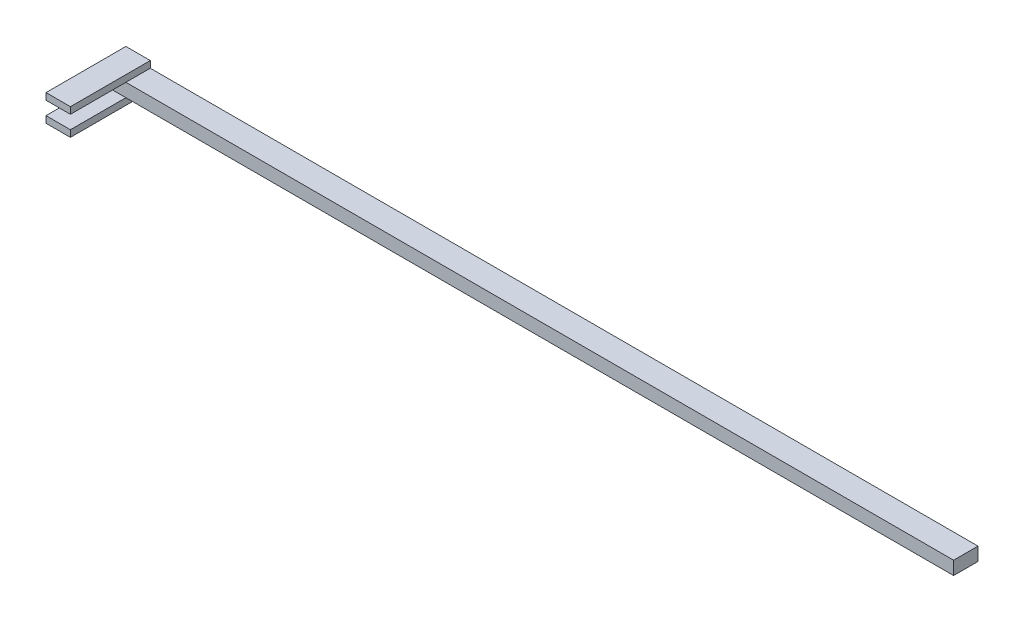
ISO-10303-21;
HEADER;
FILE_DESCRIPTION(('STEP AP214'),'2;1');
FILE_NAME('part.step','',(''),(''),'','','');
FILE_SCHEMA(('AUTOMOTIVE_DESIGN { 1 0 10303 214 1 1 1 1 }'));
ENDSEC;
DATA;
#1=APPLICATION_CONTEXT('core data for automotive mechanical design processes');
#2=APPLICATION_PROTOCOL_DEFINITION('international standard','automotive_design',2000,#1);
#3=PRODUCT_CONTEXT('',#1,'mechanical');
#4=PRODUCT('Part','Part','',(#3));
#5=PRODUCT_RELATED_PRODUCT_CATEGORY('part','',(#4));
#6=PRODUCT_DEFINITION_FORMATION('','',#4);
#7=PRODUCT_DEFINITION_CONTEXT('part definition',#1,'design');
#8=PRODUCT_DEFINITION('design','',#6,#7);
#9=PRODUCT_DEFINITION_SHAPE('','',#8);
#10=(LENGTH_UNIT() NAMED_UNIT(*) SI_UNIT(.MILLI.,.METRE.));
#11=(NAMED_UNIT(*) PLANE_ANGLE_UNIT() SI_UNIT($,.RADIAN.));
#12=(NAMED_UNIT(*) SI_UNIT($,.STERADIAN.) SOLID_ANGLE_UNIT());
#13=UNCERTAINTY_MEASURE_WITH_UNIT(LENGTH_MEASURE(1.E-05),#10,'distance_accuracy_value','');
#14=(GEOMETRIC_REPRESENTATION_CONTEXT(3) GLOBAL_UNCERTAINTY_ASSIGNED_CONTEXT((#13)) GLOBAL_UNIT_ASSIGNED_CONTEXT((#10,
#11,#12)) REPRESENTATION_CONTEXT('',''));
#15=CARTESIAN_POINT('',(0.,0.,0.));
#16=DIRECTION('',(0.,0.,1.));
#17=DIRECTION('',(1.,0.,0.));
#18=AXIS2_PLACEMENT_3D('',#15,#16,#17);
#19=CARTESIAN_POINT('',(-64.0973870149877,-38.1,-7.51266132095865));
#20=DIRECTION('',(0.,-1.,0.));
#21=DIRECTION('',(0.,0.,1.));
#22=AXIS2_PLACEMENT_3D('',#19,#20,#21);
#23=PLANE('',#22);
#24=DIRECTION('',(1.,0.,0.));
#25=VECTOR('',#24,1.);
#26=CARTESIAN_POINT('',(-64.0973870149877,-38.1,-7.51266132095865));
#27=LINE('',#26,#25);
#28=CARTESIAN_POINT('',(75.6026129850123,-38.1,-7.51266132095876));
#29=VERTEX_POINT('',#28);
#30=CARTESIAN_POINT('',(4812.70261298501,-38.1,-7.51266132095865));
#31=VERTEX_POINT('',#30);
#32=EDGE_CURVE('E180',#29,#31,#27,.T.);
#33=ORIENTED_EDGE('',*,*,#32,.F.);
#34=DIRECTION('',(0.,0.,-1.));
#35=VECTOR('',#34,1.);
#36=CARTESIAN_POINT('',(75.6026129850123,-38.1,-147.212661320959));
#37=LINE('',#36,#35);
#38=CARTESIAN_POINT('',(75.6026129850122,-38.1,-147.212661320959));
#39=VERTEX_POINT('',#38);
#40=EDGE_CURVE('E11',#29,#39,#37,.T.);
#41=ORIENTED_EDGE('',*,*,#40,.T.);
#42=DIRECTION('',(-1.,0.,0.));
#43=VECTOR('',#42,1.);
#44=CARTESIAN_POINT('',(-64.0973870149877,-38.1,-147.212661320959));
#45=LINE('',#44,#43);
#46=CARTESIAN_POINT('',(4812.70261298501,-38.1,-147.212661320959));
#47=VERTEX_POINT('',#46);
#48=EDGE_CURVE('E162',#47,#39,#45,.T.);
#49=ORIENTED_EDGE('',*,*,#48,.F.);
#50=DIRECTION('',(0.,0.,-1.));
#51=VECTOR('',#50,1.);
#52=CARTESIAN_POINT('',(4812.70261298501,-38.1,-147.212661320959));
#53=LINE('',#52,#51);
#54=EDGE_CURVE('E160',#31,#47,#53,.T.);
#55=ORIENTED_EDGE('',*,*,#54,.F.);
#56=EDGE_LOOP('',(#33,#41,#49,#55));
#57=FACE_BOUND('',#56,.T.);
#58=ADVANCED_FACE('F31',(#57),#23,.T.);
#59=CARTESIAN_POINT('',(-64.0973870149877,38.1,-147.212661320959));
#60=DIRECTION('',(1.,0.,0.));
#61=DIRECTION('',(0.,0.,-1.));
#62=AXIS2_PLACEMENT_3D('',#59,#60,#61);
#63=PLANE('',#62);
#64=DIRECTION('',(0.,-1.,0.));
#65=VECTOR('',#64,1.);
#66=CARTESIAN_POINT('',(-64.0973870149877,38.1,-147.212661320959));
#67=LINE('',#66,#65);
#68=CARTESIAN_POINT('',(-64.0973870149877,76.2,-147.212661320959));
#69=VERTEX_POINT('',#68);
#70=CARTESIAN_POINT('',(-64.0973870149877,-76.2,-147.212661320959));
#71=VERTEX_POINT('',#70);
#72=EDGE_CURVE('E115',#69,#71,#67,.T.);
#73=ORIENTED_EDGE('',*,*,#72,.T.);
#74=DIRECTION('',(0.,0.,1.));
#75=VECTOR('',#74,1.);
#76=CARTESIAN_POINT('',(-64.0973870149877,-76.2,-147.212661320959));
#77=LINE('',#76,#75);
#78=CARTESIAN_POINT('',(-64.0973870149877,-76.2,309.987338679041));
#79=VERTEX_POINT('',#78);
#80=EDGE_CURVE('E118',#71,#79,#77,.T.);
#81=ORIENTED_EDGE('',*,*,#80,.T.);
#82=DIRECTION('',(0.,1.,0.));
#83=VECTOR('',#82,1.);
#84=CARTESIAN_POINT('',(-64.0973870149877,-76.2,309.987338679041));
#85=LINE('',#84,#83);
#86=CARTESIAN_POINT('',(-64.0973870149877,-38.1,309.987338679041));
#87=VERTEX_POINT('',#86);
#88=EDGE_CURVE('E146',#79,#87,#85,.T.);
#89=ORIENTED_EDGE('',*,*,#88,.T.);
#90=DIRECTION('',(0.,0.,1.));
#91=VECTOR('',#90,1.);
#92=CARTESIAN_POINT('',(-64.0973870149877,-38.1,-147.212661320959));
#93=LINE('',#92,#91);
#94=CARTESIAN_POINT('',(-64.0973870149877,-38.1,-7.51266132095876));
#95=VERTEX_POINT('',#94);
#96=EDGE_CURVE('E153',#95,#87,#93,.T.);
#97=ORIENTED_EDGE('',*,*,#96,.F.);
#98=DIRECTION('',(0.,-1.,0.));
#99=VECTOR('',#98,1.);
#100=CARTESIAN_POINT('',(-64.0973870149877,38.1,-7.51266132095865));
#101=LINE('',#100,#99);
#102=CARTESIAN_POINT('',(-64.0973870149877,38.1,-7.51266132095865));
#103=VERTEX_POINT('',#102);
#104=EDGE_CURVE('E189',#103,#95,#101,.T.);
#105=ORIENTED_EDGE('',*,*,#104,.F.);
#106=DIRECTION('',(0.,0.,1.));
#107=VECTOR('',#106,1.);
#108=CARTESIAN_POINT('',(-64.0973870149877,38.1,-147.212661320959));
#109=LINE('',#108,#107);
#110=CARTESIAN_POINT('',(-64.0973870149877,38.1,309.987338679041));
#111=VERTEX_POINT('',#110);
#112=EDGE_CURVE('E190',#103,#111,#109,.T.);
#113=ORIENTED_EDGE('',*,*,#112,.T.);
#114=DIRECTION('',(0.,-1.,0.));
#115=VECTOR('',#114,1.);
#116=CARTESIAN_POINT('',(-64.0973870149877,76.2,309.987338679041));
#117=LINE('',#116,#115);
#118=CARTESIAN_POINT('',(-64.0973870149877,76.2,309.987338679041));
#119=VERTEX_POINT('',#118);
#120=EDGE_CURVE('E200',#119,#111,#117,.T.);
#121=ORIENTED_EDGE('',*,*,#120,.F.);
#122=DIRECTION('',(0.,0.,1.));
#123=VECTOR('',#122,1.);
#124=CARTESIAN_POINT('',(-64.0973870149877,76.2,-147.212661320959));
#125=LINE('',#124,#123);
#126=EDGE_CURVE('E122',#69,#119,#125,.T.);
#127=ORIENTED_EDGE('',*,*,#126,.F.);
#128=EDGE_LOOP('',(#73,#81,#89,#97,#105,#113,#121,#127));
#129=FACE_BOUND('',#128,.T.);
#130=ADVANCED_FACE('F33',(#129),#63,.F.);
#131=CARTESIAN_POINT('',(-64.0973870149877,38.1,-7.51266132095865));
#132=DIRECTION('',(0.,0.,-1.));
#133=DIRECTION('',(-1.,0.,0.));
#134=AXIS2_PLACEMENT_3D('',#131,#132,#133);
#135=PLANE('',#134);
#136=ORIENTED_EDGE('',*,*,#104,.T.);
#137=EDGE_CURVE('E35',#95,#29,#27,.T.);
#138=ORIENTED_EDGE('',*,*,#137,.T.);
#139=ORIENTED_EDGE('',*,*,#32,.T.);
#140=DIRECTION('',(0.,-1.,0.));
#141=VECTOR('',#140,1.);
#142=CARTESIAN_POINT('',(4812.70261298501,38.1,-7.51266132095865));
#143=LINE('',#142,#141);
#144=CARTESIAN_POINT('',(4812.70261298501,38.1,-7.51266132095865));
#145=VERTEX_POINT('',#144);
#146=EDGE_CURVE('E226',#145,#31,#143,.T.);
#147=ORIENTED_EDGE('',*,*,#146,.F.);
#148=DIRECTION('',(1.,0.,0.));
#149=VECTOR('',#148,1.);
#150=CARTESIAN_POINT('',(-64.0973870149877,38.1,-7.51266132095865));
#151=LINE('',#150,#149);
#152=CARTESIAN_POINT('',(75.6026129850122,38.1,-7.51266132095865));
#153=VERTEX_POINT('',#152);
#154=EDGE_CURVE('E202',#153,#145,#151,.T.);
#155=ORIENTED_EDGE('',*,*,#154,.F.);
#156=EDGE_CURVE('E223',#103,#153,#151,.T.);
#157=ORIENTED_EDGE('',*,*,#156,.F.);
#158=EDGE_LOOP('',(#136,#138,#139,#147,#155,#157));
#159=FACE_BOUND('',#158,.T.);
#160=ADVANCED_FACE('F187',(#159),#135,.F.);
#161=CARTESIAN_POINT('',(4812.70261298501,38.1,-147.212661320959));
#162=DIRECTION('',(-1.,0.,0.));
#163=DIRECTION('',(0.,0.,1.));
#164=AXIS2_PLACEMENT_3D('',#161,#162,#163);
#165=PLANE('',#164);
#166=ORIENTED_EDGE('',*,*,#146,.T.);
#167=ORIENTED_EDGE('',*,*,#54,.T.);
#168=DIRECTION('',(0.,-1.,0.));
#169=VECTOR('',#168,1.);
#170=CARTESIAN_POINT('',(4812.70261298501,38.1,-147.212661320959));
#171=LINE('',#170,#169);
#172=CARTESIAN_POINT('',(4812.70261298501,38.1,-147.212661320959));
#173=VERTEX_POINT('',#172);
#174=EDGE_CURVE('E127',#173,#47,#171,.T.);
#175=ORIENTED_EDGE('',*,*,#174,.F.);
#176=DIRECTION('',(0.,0.,-1.));
#177=VECTOR('',#176,1.);
#178=CARTESIAN_POINT('',(4812.70261298501,38.1,-147.212661320959));
#179=LINE('',#178,#177);
#180=EDGE_CURVE('E225',#145,#173,#179,.T.);
#181=ORIENTED_EDGE('',*,*,#180,.F.);
#182=EDGE_LOOP('',(#166,#167,#175,#181));
#183=FACE_BOUND('',#182,.T.);
#184=ADVANCED_FACE('F252',(#183),#165,.F.);
#185=CARTESIAN_POINT('',(-64.0973870149877,38.1,-147.212661320959));
#186=DIRECTION('',(0.,0.,1.));
#187=DIRECTION('',(1.,0.,0.));
#188=AXIS2_PLACEMENT_3D('',#185,#186,#187);
#189=PLANE('',#188);
#190=ORIENTED_EDGE('',*,*,#174,.T.);
#191=ORIENTED_EDGE('',*,*,#48,.T.);
#192=DIRECTION('',(0.,1.,0.));
#193=VECTOR('',#192,1.);
#194=CARTESIAN_POINT('',(75.6026129850123,-76.2,-147.212661320959));
#195=LINE('',#194,#193);
#196=CARTESIAN_POINT('',(75.6026129850123,-76.2,-147.212661320959));
#197=VERTEX_POINT('',#196);
#198=EDGE_CURVE('E49',#197,#39,#195,.T.);
#199=ORIENTED_EDGE('',*,*,#198,.F.);
#200=DIRECTION('',(-1.,0.,0.));
#201=VECTOR('',#200,1.);
#202=CARTESIAN_POINT('',(-64.0973870149877,-76.2,-147.212661320959));
#203=LINE('',#202,#201);
#204=EDGE_CURVE('E134',#197,#71,#203,.T.);
#205=ORIENTED_EDGE('',*,*,#204,.T.);
#206=ORIENTED_EDGE('',*,*,#72,.F.);
#207=DIRECTION('',(-1.,0.,0.));
#208=VECTOR('',#207,1.);
#209=CARTESIAN_POINT('',(-64.0973870149877,76.2,-147.212661320959));
#210=LINE('',#209,#208);
#211=CARTESIAN_POINT('',(75.6026129850123,76.2,-147.212661320959));
#212=VERTEX_POINT('',#211);
#213=EDGE_CURVE('E207',#212,#69,#210,.T.);
#214=ORIENTED_EDGE('',*,*,#213,.F.);
#215=DIRECTION('',(0.,-1.,0.));
#216=VECTOR('',#215,1.);
#217=CARTESIAN_POINT('',(75.6026129850123,76.2,-147.212661320959));
#218=LINE('',#217,#216);
#219=CARTESIAN_POINT('',(75.6026129850123,38.1,-147.212661320959));
#220=VERTEX_POINT('',#219);
#221=EDGE_CURVE('E218',#212,#220,#218,.T.);
#222=ORIENTED_EDGE('',*,*,#221,.T.);
#223=DIRECTION('',(-1.,0.,0.));
#224=VECTOR('',#223,1.);
#225=CARTESIAN_POINT('',(-64.0973870149877,38.1,-147.212661320959));
#226=LINE('',#225,#224);
#227=EDGE_CURVE('E128',#173,#220,#226,.T.);
#228=ORIENTED_EDGE('',*,*,#227,.F.);
#229=EDGE_LOOP('',(#190,#191,#199,#205,#206,#214,#222,#228));
#230=FACE_BOUND('',#229,.T.);
#231=ADVANCED_FACE('F139',(#230),#189,.F.);
#232=CARTESIAN_POINT('',(-64.0973870149877,38.1,-7.51266132095865));
#233=DIRECTION('',(0.,1.,0.));
#234=DIRECTION('',(0.,0.,1.));
#235=AXIS2_PLACEMENT_3D('',#232,#233,#234);
#236=PLANE('',#235);
#237=DIRECTION('',(0.,0.,-1.));
#238=VECTOR('',#237,1.);
#239=CARTESIAN_POINT('',(75.6026129850123,38.1,-147.212661320959));
#240=LINE('',#239,#238);
#241=EDGE_CURVE('E41',#153,#220,#240,.T.);
#242=ORIENTED_EDGE('',*,*,#241,.F.);
#243=ORIENTED_EDGE('',*,*,#154,.T.);
#244=ORIENTED_EDGE('',*,*,#180,.T.);
#245=ORIENTED_EDGE('',*,*,#227,.T.);
#246=EDGE_LOOP('',(#242,#243,#244,#245));
#247=FACE_BOUND('',#246,.T.);
#248=ADVANCED_FACE('F233',(#247),#236,.T.);
#249=CARTESIAN_POINT('',(-64.0973870149877,38.1,309.987338679041));
#250=DIRECTION('',(0.,1.,0.));
#251=DIRECTION('',(0.,0.,1.));
#252=AXIS2_PLACEMENT_3D('',#249,#250,#251);
#253=PLANE('',#252);
#254=ORIENTED_EDGE('',*,*,#112,.F.);
#255=ORIENTED_EDGE('',*,*,#156,.T.);
#256=CARTESIAN_POINT('',(75.6026129850123,38.1,309.987338679041));
#257=VERTEX_POINT('',#256);
#258=EDGE_CURVE('E195',#257,#153,#240,.T.);
#259=ORIENTED_EDGE('',*,*,#258,.F.);
#260=DIRECTION('',(1.,0.,0.));
#261=VECTOR('',#260,1.);
#262=CARTESIAN_POINT('',(-64.0973870149877,38.1,309.987338679041));
#263=LINE('',#262,#261);
#264=EDGE_CURVE('E191',#111,#257,#263,.T.);
#265=ORIENTED_EDGE('',*,*,#264,.F.);
#266=EDGE_LOOP('',(#254,#255,#259,#265));
#267=FACE_BOUND('',#266,.T.);
#268=ADVANCED_FACE('F251',(#267),#253,.F.);
#269=CARTESIAN_POINT('',(-64.0973870149877,76.2,309.987338679041));
#270=DIRECTION('',(0.,0.,-1.));
#271=DIRECTION('',(-1.,0.,0.));
#272=AXIS2_PLACEMENT_3D('',#269,#270,#271);
#273=PLANE('',#272);
#274=ORIENTED_EDGE('',*,*,#264,.T.);
#275=DIRECTION('',(0.,-1.,0.));
#276=VECTOR('',#275,1.);
#277=CARTESIAN_POINT('',(75.6026129850123,76.2,309.987338679041));
#278=LINE('',#277,#276);
#279=CARTESIAN_POINT('',(75.6026129850123,76.2,309.987338679041));
#280=VERTEX_POINT('',#279);
#281=EDGE_CURVE('E212',#280,#257,#278,.T.);
#282=ORIENTED_EDGE('',*,*,#281,.F.);
#283=DIRECTION('',(1.,0.,0.));
#284=VECTOR('',#283,1.);
#285=CARTESIAN_POINT('',(-64.0973870149877,76.2,309.987338679041));
#286=LINE('',#285,#284);
#287=EDGE_CURVE('E242',#119,#280,#286,.T.);
#288=ORIENTED_EDGE('',*,*,#287,.F.);
#289=ORIENTED_EDGE('',*,*,#120,.T.);
#290=EDGE_LOOP('',(#274,#282,#288,#289));
#291=FACE_BOUND('',#290,.T.);
#292=ADVANCED_FACE('F273',(#291),#273,.F.);
#293=CARTESIAN_POINT('',(75.6026129850123,76.2,-147.212661320959));
#294=DIRECTION('',(-1.,0.,0.));
#295=DIRECTION('',(0.,0.,1.));
#296=AXIS2_PLACEMENT_3D('',#293,#294,#295);
#297=PLANE('',#296);
#298=ORIENTED_EDGE('',*,*,#258,.T.);
#299=ORIENTED_EDGE('',*,*,#241,.T.);
#300=ORIENTED_EDGE('',*,*,#221,.F.);
#301=DIRECTION('',(0.,0.,-1.));
#302=VECTOR('',#301,1.);
#303=CARTESIAN_POINT('',(75.6026129850123,76.2,-147.212661320959));
#304=LINE('',#303,#302);
#305=EDGE_CURVE('E241',#280,#212,#304,.T.);
#306=ORIENTED_EDGE('',*,*,#305,.F.);
#307=ORIENTED_EDGE('',*,*,#281,.T.);
#308=EDGE_LOOP('',(#298,#299,#300,#306,#307));
#309=FACE_BOUND('',#308,.T.);
#310=ADVANCED_FACE('F236',(#309),#297,.F.);
#311=CARTESIAN_POINT('',(-64.0973870149877,76.2,309.987338679041));
#312=DIRECTION('',(0.,1.,0.));
#313=DIRECTION('',(0.,0.,1.));
#314=AXIS2_PLACEMENT_3D('',#311,#312,#313);
#315=PLANE('',#314);
#316=ORIENTED_EDGE('',*,*,#126,.T.);
#317=ORIENTED_EDGE('',*,*,#287,.T.);
#318=ORIENTED_EDGE('',*,*,#305,.T.);
#319=ORIENTED_EDGE('',*,*,#213,.T.);
#320=EDGE_LOOP('',(#316,#317,#318,#319));
#321=FACE_BOUND('',#320,.T.);
#322=ADVANCED_FACE('F246',(#321),#315,.T.);
#323=CARTESIAN_POINT('',(75.6026129850123,-76.2,-147.212661320959));
#324=DIRECTION('',(1.,0.,0.));
#325=DIRECTION('',(0.,0.,-1.));
#326=AXIS2_PLACEMENT_3D('',#323,#324,#325);
#327=PLANE('',#326);
#328=CARTESIAN_POINT('',(75.6026129850123,-38.1,309.987338679041));
#329=VERTEX_POINT('',#328);
#330=EDGE_CURVE('E149',#329,#29,#37,.T.);
#331=ORIENTED_EDGE('',*,*,#330,.F.);
#332=DIRECTION('',(0.,1.,0.));
#333=VECTOR('',#332,1.);
#334=CARTESIAN_POINT('',(75.6026129850123,-76.2,309.987338679041));
#335=LINE('',#334,#333);
#336=CARTESIAN_POINT('',(75.6026129850123,-76.2,309.987338679041));
#337=VERTEX_POINT('',#336);
#338=EDGE_CURVE('E156',#337,#329,#335,.T.);
#339=ORIENTED_EDGE('',*,*,#338,.F.);
#340=DIRECTION('',(0.,0.,-1.));
#341=VECTOR('',#340,1.);
#342=CARTESIAN_POINT('',(75.6026129850123,-76.2,-147.212661320959));
#343=LINE('',#342,#341);
#344=EDGE_CURVE('E141',#337,#197,#343,.T.);
#345=ORIENTED_EDGE('',*,*,#344,.T.);
#346=ORIENTED_EDGE('',*,*,#198,.T.);
#347=ORIENTED_EDGE('',*,*,#40,.F.);
#348=EDGE_LOOP('',(#331,#339,#345,#346,#347));
#349=FACE_BOUND('',#348,.T.);
#350=ADVANCED_FACE('F267',(#349),#327,.T.);
#351=CARTESIAN_POINT('',(-64.0973870149877,-76.2,309.987338679041));
#352=DIRECTION('',(0.,0.,1.));
#353=DIRECTION('',(1.,0.,0.));
#354=AXIS2_PLACEMENT_3D('',#351,#352,#353);
#355=PLANE('',#354);
#356=DIRECTION('',(1.,0.,0.));
#357=VECTOR('',#356,1.);
#358=CARTESIAN_POINT('',(-64.0973870149877,-38.1,309.987338679041));
#359=LINE('',#358,#357);
#360=EDGE_CURVE('E137',#87,#329,#359,.T.);
#361=ORIENTED_EDGE('',*,*,#360,.F.);
#362=ORIENTED_EDGE('',*,*,#88,.F.);
#363=DIRECTION('',(1.,0.,0.));
#364=VECTOR('',#363,1.);
#365=CARTESIAN_POINT('',(-64.0973870149877,-76.2,309.987338679041));
#366=LINE('',#365,#364);
#367=EDGE_CURVE('E136',#79,#337,#366,.T.);
#368=ORIENTED_EDGE('',*,*,#367,.T.);
#369=ORIENTED_EDGE('',*,*,#338,.T.);
#370=EDGE_LOOP('',(#361,#362,#368,#369));
#371=FACE_BOUND('',#370,.T.);
#372=ADVANCED_FACE('F305',(#371),#355,.T.);
#373=CARTESIAN_POINT('',(-64.0973870149877,-76.2,309.987338679041));
#374=DIRECTION('',(0.,-1.,0.));
#375=DIRECTION('',(0.,0.,1.));
#376=AXIS2_PLACEMENT_3D('',#373,#374,#375);
#377=PLANE('',#376);
#378=ORIENTED_EDGE('',*,*,#80,.F.);
#379=ORIENTED_EDGE('',*,*,#204,.F.);
#380=ORIENTED_EDGE('',*,*,#344,.F.);
#381=ORIENTED_EDGE('',*,*,#367,.F.);
#382=EDGE_LOOP('',(#378,#379,#380,#381));
#383=FACE_BOUND('',#382,.T.);
#384=ADVANCED_FACE('F132',(#383),#377,.T.);
#385=CARTESIAN_POINT('',(-64.0973870149877,-38.1,309.987338679041));
#386=DIRECTION('',(0.,-1.,0.));
#387=DIRECTION('',(0.,0.,1.));
#388=AXIS2_PLACEMENT_3D('',#385,#386,#387);
#389=PLANE('',#388);
#390=ORIENTED_EDGE('',*,*,#137,.F.);
#391=ORIENTED_EDGE('',*,*,#96,.T.);
#392=ORIENTED_EDGE('',*,*,#360,.T.);
#393=ORIENTED_EDGE('',*,*,#330,.T.);
#394=EDGE_LOOP('',(#390,#391,#392,#393));
#395=FACE_BOUND('',#394,.T.);
#396=ADVANCED_FACE('F176',(#395),#389,.F.);
#397=CLOSED_SHELL('',(#58,#130,#160,#184,#231,#248,#268,#292,#310,#322,#350,#372,#384,#396));
#398=MANIFOLD_SOLID_BREP('B2',#397);
#399=ADVANCED_BREP_SHAPE_REPRESENTATION('',(#18,#398),#14);
#400=SHAPE_DEFINITION_REPRESENTATION(#9,#399);
ENDSEC;
END-ISO-10303-21;
